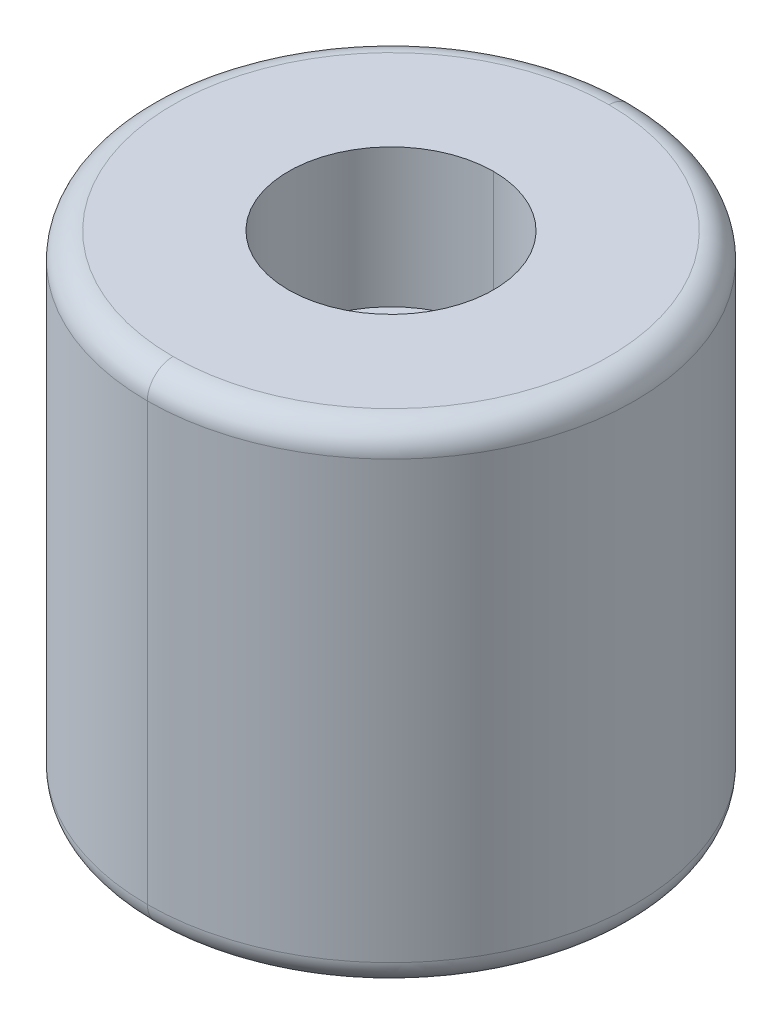
ISO-10303-21;
HEADER;
FILE_DESCRIPTION(('STEP AP214'),'2;1');
FILE_NAME('part.step','',(''),(''),'','','');
FILE_SCHEMA(('AUTOMOTIVE_DESIGN { 1 0 10303 214 1 1 1 1 }'));
ENDSEC;
DATA;
#1=APPLICATION_CONTEXT('core data for automotive mechanical design processes');
#2=APPLICATION_PROTOCOL_DEFINITION('international standard','automotive_design',2000,#1);
#3=PRODUCT_CONTEXT('',#1,'mechanical');
#4=PRODUCT('Part','Part','',(#3));
#5=PRODUCT_RELATED_PRODUCT_CATEGORY('part','',(#4));
#6=PRODUCT_DEFINITION_FORMATION('','',#4);
#7=PRODUCT_DEFINITION_CONTEXT('part definition',#1,'design');
#8=PRODUCT_DEFINITION('design','',#6,#7);
#9=PRODUCT_DEFINITION_SHAPE('','',#8);
#10=(LENGTH_UNIT() NAMED_UNIT(*) SI_UNIT(.MILLI.,.METRE.));
#11=(NAMED_UNIT(*) PLANE_ANGLE_UNIT() SI_UNIT($,.RADIAN.));
#12=(NAMED_UNIT(*) SI_UNIT($,.STERADIAN.) SOLID_ANGLE_UNIT());
#13=UNCERTAINTY_MEASURE_WITH_UNIT(LENGTH_MEASURE(1.E-05),#10,'distance_accuracy_value','');
#14=(GEOMETRIC_REPRESENTATION_CONTEXT(3) GLOBAL_UNCERTAINTY_ASSIGNED_CONTEXT((#13)) GLOBAL_UNIT_ASSIGNED_CONTEXT((#10,
#11,#12)) REPRESENTATION_CONTEXT('',''));
#15=CARTESIAN_POINT('',(0.,0.,0.));
#16=DIRECTION('',(0.,0.,1.));
#17=DIRECTION('',(1.,0.,0.));
#18=AXIS2_PLACEMENT_3D('',#15,#16,#17);
#19=CARTESIAN_POINT('',(0.,18.,0.));
#20=DIRECTION('',(0.,1.,0.));
#21=DIRECTION('',(0.,0.,1.));
#22=AXIS2_PLACEMENT_3D('',#19,#20,#21);
#23=TOROIDAL_SURFACE('',#22,8.5,1.);
#24=CARTESIAN_POINT('',(0.,18.,-8.5));
#25=DIRECTION('',(1.,0.,0.));
#26=DIRECTION('',(0.,0.,-1.));
#27=AXIS2_PLACEMENT_3D('',#24,#25,#26);
#28=CIRCLE('',#27,1.);
#29=CARTESIAN_POINT('',(0.,18.,-9.5));
#30=VERTEX_POINT('',#29);
#31=CARTESIAN_POINT('',(0.,19.,-8.5));
#32=VERTEX_POINT('',#31);
#33=EDGE_CURVE('E144',#30,#32,#28,.T.);
#34=ORIENTED_EDGE('',*,*,#33,.F.);
#35=CARTESIAN_POINT('',(0.,18.,0.));
#36=DIRECTION('',(0.,-1.,0.));
#37=DIRECTION('',(0.,0.,1.));
#38=AXIS2_PLACEMENT_3D('',#35,#36,#37);
#39=CIRCLE('',#38,9.5);
#40=CARTESIAN_POINT('',(0.,18.,9.5));
#41=VERTEX_POINT('',#40);
#42=EDGE_CURVE('E119',#41,#30,#39,.T.);
#43=ORIENTED_EDGE('',*,*,#42,.F.);
#44=CARTESIAN_POINT('',(0.,18.,8.5));
#45=DIRECTION('',(-1.,0.,0.));
#46=DIRECTION('',(0.,0.,1.));
#47=AXIS2_PLACEMENT_3D('',#44,#45,#46);
#48=CIRCLE('',#47,1.);
#49=CARTESIAN_POINT('',(0.,19.,8.5));
#50=VERTEX_POINT('',#49);
#51=EDGE_CURVE('E153',#41,#50,#48,.T.);
#52=ORIENTED_EDGE('',*,*,#51,.T.);
#53=CARTESIAN_POINT('',(0.,19.,0.));
#54=DIRECTION('',(0.,1.,0.));
#55=DIRECTION('',(0.,0.,1.));
#56=AXIS2_PLACEMENT_3D('',#53,#54,#55);
#57=CIRCLE('',#56,8.5);
#58=EDGE_CURVE('E145',#32,#50,#57,.T.);
#59=ORIENTED_EDGE('',*,*,#58,.F.);
#60=EDGE_LOOP('',(#34,#43,#52,#59));
#61=FACE_BOUND('',#60,.T.);
#62=ADVANCED_FACE('F16',(#61),#23,.T.);
#63=CARTESIAN_POINT('',(0.,1.,0.));
#64=DIRECTION('',(0.,1.,0.));
#65=DIRECTION('',(0.,0.,1.));
#66=AXIS2_PLACEMENT_3D('',#63,#64,#65);
#67=TOROIDAL_SURFACE('',#66,8.5,1.);
#68=CARTESIAN_POINT('',(0.,1.,-8.5));
#69=DIRECTION('',(1.,0.,0.));
#70=DIRECTION('',(0.,0.,-1.));
#71=AXIS2_PLACEMENT_3D('',#68,#69,#70);
#72=CIRCLE('',#71,1.);
#73=CARTESIAN_POINT('',(0.,0.,-8.5));
#74=VERTEX_POINT('',#73);
#75=CARTESIAN_POINT('',(0.,1.,-9.5));
#76=VERTEX_POINT('',#75);
#77=EDGE_CURVE('E172',#74,#76,#72,.T.);
#78=ORIENTED_EDGE('',*,*,#77,.F.);
#79=CARTESIAN_POINT('',(0.,0.,0.));
#80=DIRECTION('',(0.,-1.,0.));
#81=DIRECTION('',(0.,0.,1.));
#82=AXIS2_PLACEMENT_3D('',#79,#80,#81);
#83=CIRCLE('',#82,8.5);
#84=CARTESIAN_POINT('',(0.,0.,8.5));
#85=VERTEX_POINT('',#84);
#86=EDGE_CURVE('E166',#85,#74,#83,.T.);
#87=ORIENTED_EDGE('',*,*,#86,.F.);
#88=CARTESIAN_POINT('',(0.,1.,8.5));
#89=DIRECTION('',(-1.,0.,0.));
#90=DIRECTION('',(0.,0.,1.));
#91=AXIS2_PLACEMENT_3D('',#88,#89,#90);
#92=CIRCLE('',#91,1.);
#93=CARTESIAN_POINT('',(0.,1.,9.5));
#94=VERTEX_POINT('',#93);
#95=EDGE_CURVE('E167',#85,#94,#92,.T.);
#96=ORIENTED_EDGE('',*,*,#95,.T.);
#97=CARTESIAN_POINT('',(0.,1.,0.));
#98=DIRECTION('',(0.,1.,0.));
#99=DIRECTION('',(0.,0.,1.));
#100=AXIS2_PLACEMENT_3D('',#97,#98,#99);
#101=CIRCLE('',#100,9.5);
#102=EDGE_CURVE('E131',#76,#94,#101,.T.);
#103=ORIENTED_EDGE('',*,*,#102,.F.);
#104=EDGE_LOOP('',(#78,#87,#96,#103));
#105=FACE_BOUND('',#104,.T.);
#106=ADVANCED_FACE('F261',(#105),#67,.T.);
#107=CARTESIAN_POINT('',(0.,-7.4,0.));
#108=DIRECTION('',(0.,1.,0.));
#109=DIRECTION('',(0.,0.,1.));
#110=AXIS2_PLACEMENT_3D('',#107,#108,#109);
#111=CYLINDRICAL_SURFACE('',#110,1.5);
#112=DIRECTION('',(0.,1.,0.));
#113=VECTOR('',#112,1.);
#114=CARTESIAN_POINT('',(0.,-7.4,-1.5));
#115=LINE('',#114,#113);
#116=CARTESIAN_POINT('',(0.,5.4,-1.5));
#117=VERTEX_POINT('',#116);
#118=CARTESIAN_POINT('',(0.,13.6,-1.5));
#119=VERTEX_POINT('',#118);
#120=EDGE_CURVE('E192',#117,#119,#115,.T.);
#121=ORIENTED_EDGE('',*,*,#120,.F.);
#122=CARTESIAN_POINT('',(0.,5.4,0.));
#123=DIRECTION('',(0.,1.,0.));
#124=DIRECTION('',(0.,0.,1.));
#125=AXIS2_PLACEMENT_3D('',#122,#123,#124);
#126=CIRCLE('',#125,1.5);
#127=CARTESIAN_POINT('',(0.,5.4,1.5));
#128=VERTEX_POINT('',#127);
#129=EDGE_CURVE('E10',#128,#117,#126,.T.);
#130=ORIENTED_EDGE('',*,*,#129,.F.);
#131=DIRECTION('',(0.,1.,0.));
#132=VECTOR('',#131,1.);
#133=CARTESIAN_POINT('',(0.,-7.4,1.5));
#134=LINE('',#133,#132);
#135=CARTESIAN_POINT('',(0.,13.6,1.5));
#136=VERTEX_POINT('',#135);
#137=EDGE_CURVE('E201',#128,#136,#134,.T.);
#138=ORIENTED_EDGE('',*,*,#137,.T.);
#139=CARTESIAN_POINT('',(0.,13.6,0.));
#140=DIRECTION('',(0.,1.,0.));
#141=DIRECTION('',(0.,0.,1.));
#142=AXIS2_PLACEMENT_3D('',#139,#140,#141);
#143=CIRCLE('',#142,1.5);
#144=EDGE_CURVE('E235',#136,#119,#143,.T.);
#145=ORIENTED_EDGE('',*,*,#144,.T.);
#146=EDGE_LOOP('',(#121,#130,#138,#145));
#147=FACE_BOUND('',#146,.T.);
#148=ADVANCED_FACE('F251',(#147),#111,.F.);
#149=CARTESIAN_POINT('',(0.,5.4,0.));
#150=DIRECTION('',(0.,1.,0.));
#151=DIRECTION('',(1.,0.,0.));
#152=AXIS2_PLACEMENT_3D('',#149,#150,#151);
#153=PLANE('',#152);
#154=ORIENTED_EDGE('',*,*,#129,.T.);
#155=CARTESIAN_POINT('',(0.,5.4,0.));
#156=DIRECTION('',(0.,1.,0.));
#157=DIRECTION('',(0.,0.,1.));
#158=AXIS2_PLACEMENT_3D('',#155,#156,#157);
#159=CIRCLE('',#158,1.5);
#160=EDGE_CURVE('E171',#117,#128,#159,.T.);
#161=ORIENTED_EDGE('',*,*,#160,.T.);
#162=EDGE_LOOP('',(#154,#161));
#163=FACE_BOUND('',#162,.T.);
#164=CARTESIAN_POINT('',(0.,5.4,0.));
#165=DIRECTION('',(0.,1.,0.));
#166=DIRECTION('',(0.,0.,1.));
#167=AXIS2_PLACEMENT_3D('',#164,#165,#166);
#168=CIRCLE('',#167,4.);
#169=CARTESIAN_POINT('',(0.,5.4,-4.));
#170=VERTEX_POINT('',#169);
#171=CARTESIAN_POINT('',(0.,5.4,4.));
#172=VERTEX_POINT('',#171);
#173=EDGE_CURVE('E202',#170,#172,#168,.T.);
#174=ORIENTED_EDGE('',*,*,#173,.F.);
#175=CARTESIAN_POINT('',(0.,5.4,0.));
#176=DIRECTION('',(0.,1.,0.));
#177=DIRECTION('',(0.,0.,1.));
#178=AXIS2_PLACEMENT_3D('',#175,#176,#177);
#179=CIRCLE('',#178,4.);
#180=EDGE_CURVE('E24',#172,#170,#179,.T.);
#181=ORIENTED_EDGE('',*,*,#180,.F.);
#182=EDGE_LOOP('',(#174,#181));
#183=FACE_BOUND('',#182,.T.);
#184=ADVANCED_FACE('F249',(#163,#183),#153,.F.);
#185=CARTESIAN_POINT('',(0.,5.4,0.));
#186=DIRECTION('',(0.,-1.,0.));
#187=DIRECTION('',(0.,0.,-1.));
#188=AXIS2_PLACEMENT_3D('',#185,#186,#187);
#189=CYLINDRICAL_SURFACE('',#188,4.);
#190=DIRECTION('',(0.,-1.,0.));
#191=VECTOR('',#190,1.);
#192=CARTESIAN_POINT('',(0.,5.4,4.));
#193=LINE('',#192,#191);
#194=CARTESIAN_POINT('',(0.,0.,4.));
#195=VERTEX_POINT('',#194);
#196=EDGE_CURVE('E206',#172,#195,#193,.T.);
#197=ORIENTED_EDGE('',*,*,#196,.F.);
#198=ORIENTED_EDGE('',*,*,#180,.T.);
#199=DIRECTION('',(0.,-1.,0.));
#200=VECTOR('',#199,1.);
#201=CARTESIAN_POINT('',(0.,5.4,-4.));
#202=LINE('',#201,#200);
#203=CARTESIAN_POINT('',(0.,0.,-4.));
#204=VERTEX_POINT('',#203);
#205=EDGE_CURVE('E188',#170,#204,#202,.T.);
#206=ORIENTED_EDGE('',*,*,#205,.T.);
#207=CARTESIAN_POINT('',(0.,0.,0.));
#208=DIRECTION('',(0.,1.,0.));
#209=DIRECTION('',(0.,0.,1.));
#210=AXIS2_PLACEMENT_3D('',#207,#208,#209);
#211=CIRCLE('',#210,4.);
#212=EDGE_CURVE('E163',#195,#204,#211,.T.);
#213=ORIENTED_EDGE('',*,*,#212,.F.);
#214=EDGE_LOOP('',(#197,#198,#206,#213));
#215=FACE_BOUND('',#214,.T.);
#216=ADVANCED_FACE('F243',(#215),#189,.F.);
#217=CARTESIAN_POINT('',(0.,13.6,0.));
#218=DIRECTION('',(0.,1.,0.));
#219=DIRECTION('',(1.,0.,0.));
#220=AXIS2_PLACEMENT_3D('',#217,#218,#219);
#221=PLANE('',#220);
#222=ORIENTED_EDGE('',*,*,#144,.F.);
#223=CARTESIAN_POINT('',(0.,13.6,0.));
#224=DIRECTION('',(0.,1.,0.));
#225=DIRECTION('',(0.,0.,1.));
#226=AXIS2_PLACEMENT_3D('',#223,#224,#225);
#227=CIRCLE('',#226,1.5);
#228=EDGE_CURVE('E197',#119,#136,#227,.T.);
#229=ORIENTED_EDGE('',*,*,#228,.F.);
#230=EDGE_LOOP('',(#222,#229));
#231=FACE_BOUND('',#230,.T.);
#232=CARTESIAN_POINT('',(0.,13.6,0.));
#233=DIRECTION('',(0.,1.,0.));
#234=DIRECTION('',(0.,0.,1.));
#235=AXIS2_PLACEMENT_3D('',#232,#233,#234);
#236=CIRCLE('',#235,4.);
#237=CARTESIAN_POINT('',(0.,13.6,4.));
#238=VERTEX_POINT('',#237);
#239=CARTESIAN_POINT('',(0.,13.6,-4.));
#240=VERTEX_POINT('',#239);
#241=EDGE_CURVE('E165',#238,#240,#236,.T.);
#242=ORIENTED_EDGE('',*,*,#241,.T.);
#243=CARTESIAN_POINT('',(0.,13.6,0.));
#244=DIRECTION('',(0.,1.,0.));
#245=DIRECTION('',(0.,0.,1.));
#246=AXIS2_PLACEMENT_3D('',#243,#244,#245);
#247=CIRCLE('',#246,4.);
#248=EDGE_CURVE('E183',#240,#238,#247,.T.);
#249=ORIENTED_EDGE('',*,*,#248,.T.);
#250=EDGE_LOOP('',(#242,#249));
#251=FACE_BOUND('',#250,.T.);
#252=ADVANCED_FACE('F259',(#231,#251),#221,.T.);
#253=CARTESIAN_POINT('',(0.,13.6,0.));
#254=DIRECTION('',(0.,1.,0.));
#255=DIRECTION('',(0.,0.,1.));
#256=AXIS2_PLACEMENT_3D('',#253,#254,#255);
#257=CYLINDRICAL_SURFACE('',#256,4.);
#258=DIRECTION('',(0.,1.,0.));
#259=VECTOR('',#258,1.);
#260=CARTESIAN_POINT('',(0.,13.6,-4.));
#261=LINE('',#260,#259);
#262=CARTESIAN_POINT('',(0.,19.,-4.));
#263=VERTEX_POINT('',#262);
#264=EDGE_CURVE('E187',#240,#263,#261,.T.);
#265=ORIENTED_EDGE('',*,*,#264,.F.);
#266=ORIENTED_EDGE('',*,*,#241,.F.);
#267=DIRECTION('',(0.,1.,0.));
#268=VECTOR('',#267,1.);
#269=CARTESIAN_POINT('',(0.,13.6,4.));
#270=LINE('',#269,#268);
#271=CARTESIAN_POINT('',(0.,19.,4.));
#272=VERTEX_POINT('',#271);
#273=EDGE_CURVE('E222',#238,#272,#270,.T.);
#274=ORIENTED_EDGE('',*,*,#273,.T.);
#275=CARTESIAN_POINT('',(0.,19.,0.));
#276=DIRECTION('',(0.,1.,0.));
#277=DIRECTION('',(0.,0.,1.));
#278=AXIS2_PLACEMENT_3D('',#275,#276,#277);
#279=CIRCLE('',#278,4.);
#280=EDGE_CURVE('E36',#272,#263,#279,.T.);
#281=ORIENTED_EDGE('',*,*,#280,.T.);
#282=EDGE_LOOP('',(#265,#266,#274,#281));
#283=FACE_BOUND('',#282,.T.);
#284=ADVANCED_FACE('F288',(#283),#257,.F.);
#285=CARTESIAN_POINT('',(0.,0.,0.));
#286=DIRECTION('',(0.,1.,0.));
#287=DIRECTION('',(1.,0.,0.));
#288=AXIS2_PLACEMENT_3D('',#285,#286,#287);
#289=PLANE('',#288);
#290=CARTESIAN_POINT('',(0.,0.,0.));
#291=DIRECTION('',(0.,1.,0.));
#292=DIRECTION('',(0.,0.,1.));
#293=AXIS2_PLACEMENT_3D('',#290,#291,#292);
#294=CIRCLE('',#293,4.);
#295=EDGE_CURVE('E196',#204,#195,#294,.T.);
#296=ORIENTED_EDGE('',*,*,#295,.T.);
#297=ORIENTED_EDGE('',*,*,#212,.T.);
#298=EDGE_LOOP('',(#296,#297));
#299=FACE_BOUND('',#298,.T.);
#300=ORIENTED_EDGE('',*,*,#86,.T.);
#301=CARTESIAN_POINT('',(0.,0.,0.));
#302=DIRECTION('',(0.,-1.,0.));
#303=DIRECTION('',(0.,0.,1.));
#304=AXIS2_PLACEMENT_3D('',#301,#302,#303);
#305=CIRCLE('',#304,8.5);
#306=EDGE_CURVE('E174',#74,#85,#305,.T.);
#307=ORIENTED_EDGE('',*,*,#306,.T.);
#308=EDGE_LOOP('',(#300,#307));
#309=FACE_BOUND('',#308,.T.);
#310=ADVANCED_FACE('F291',(#299,#309),#289,.F.);
#311=CARTESIAN_POINT('',(0.,19.,0.));
#312=DIRECTION('',(0.,1.,0.));
#313=DIRECTION('',(1.,0.,0.));
#314=AXIS2_PLACEMENT_3D('',#311,#312,#313);
#315=PLANE('',#314);
#316=ORIENTED_EDGE('',*,*,#280,.F.);
#317=CARTESIAN_POINT('',(0.,19.,0.));
#318=DIRECTION('',(0.,1.,0.));
#319=DIRECTION('',(0.,0.,1.));
#320=AXIS2_PLACEMENT_3D('',#317,#318,#319);
#321=CIRCLE('',#320,4.);
#322=EDGE_CURVE('E216',#263,#272,#321,.T.);
#323=ORIENTED_EDGE('',*,*,#322,.F.);
#324=EDGE_LOOP('',(#316,#323));
#325=FACE_BOUND('',#324,.T.);
#326=CARTESIAN_POINT('',(0.,19.,0.));
#327=DIRECTION('',(0.,1.,0.));
#328=DIRECTION('',(0.,0.,1.));
#329=AXIS2_PLACEMENT_3D('',#326,#327,#328);
#330=CIRCLE('',#329,8.5);
#331=EDGE_CURVE('E150',#50,#32,#330,.T.);
#332=ORIENTED_EDGE('',*,*,#331,.T.);
#333=ORIENTED_EDGE('',*,*,#58,.T.);
#334=EDGE_LOOP('',(#332,#333));
#335=FACE_BOUND('',#334,.T.);
#336=ADVANCED_FACE('F287',(#325,#335),#315,.T.);
#337=CARTESIAN_POINT('',(0.,19.,0.));
#338=DIRECTION('',(0.,-1.,0.));
#339=DIRECTION('',(0.,0.,-1.));
#340=AXIS2_PLACEMENT_3D('',#337,#338,#339);
#341=CYLINDRICAL_SURFACE('',#340,9.5);
#342=DIRECTION('',(0.,-1.,0.));
#343=VECTOR('',#342,1.);
#344=CARTESIAN_POINT('',(0.,19.,9.5));
#345=LINE('',#344,#343);
#346=EDGE_CURVE('E125',#41,#94,#345,.T.);
#347=ORIENTED_EDGE('',*,*,#346,.F.);
#348=ORIENTED_EDGE('',*,*,#42,.T.);
#349=DIRECTION('',(0.,-1.,0.));
#350=VECTOR('',#349,1.);
#351=CARTESIAN_POINT('',(0.,19.,-9.5));
#352=LINE('',#351,#350);
#353=EDGE_CURVE('E122',#30,#76,#352,.T.);
#354=ORIENTED_EDGE('',*,*,#353,.T.);
#355=ORIENTED_EDGE('',*,*,#102,.T.);
#356=EDGE_LOOP('',(#347,#348,#354,#355));
#357=FACE_BOUND('',#356,.T.);
#358=ADVANCED_FACE('F121',(#357),#341,.T.);
#359=CARTESIAN_POINT('',(0.,19.,0.));
#360=DIRECTION('',(0.,-1.,0.));
#361=DIRECTION('',(0.,0.,-1.));
#362=AXIS2_PLACEMENT_3D('',#359,#360,#361);
#363=CYLINDRICAL_SURFACE('',#362,9.5);
#364=CARTESIAN_POINT('',(0.,18.,0.));
#365=DIRECTION('',(0.,-1.,0.));
#366=DIRECTION('',(0.,0.,1.));
#367=AXIS2_PLACEMENT_3D('',#364,#365,#366);
#368=CIRCLE('',#367,9.5);
#369=EDGE_CURVE('E137',#30,#41,#368,.T.);
#370=ORIENTED_EDGE('',*,*,#369,.T.);
#371=ORIENTED_EDGE('',*,*,#346,.T.);
#372=CARTESIAN_POINT('',(0.,1.,0.));
#373=DIRECTION('',(0.,1.,0.));
#374=DIRECTION('',(0.,0.,1.));
#375=AXIS2_PLACEMENT_3D('',#372,#373,#374);
#376=CIRCLE('',#375,9.5);
#377=EDGE_CURVE('E139',#94,#76,#376,.T.);
#378=ORIENTED_EDGE('',*,*,#377,.T.);
#379=ORIENTED_EDGE('',*,*,#353,.F.);
#380=EDGE_LOOP('',(#370,#371,#378,#379));
#381=FACE_BOUND('',#380,.T.);
#382=ADVANCED_FACE('F135',(#381),#363,.T.);
#383=CARTESIAN_POINT('',(0.,13.6,0.));
#384=DIRECTION('',(0.,1.,0.));
#385=DIRECTION('',(0.,0.,1.));
#386=AXIS2_PLACEMENT_3D('',#383,#384,#385);
#387=CYLINDRICAL_SURFACE('',#386,4.);
#388=ORIENTED_EDGE('',*,*,#248,.F.);
#389=ORIENTED_EDGE('',*,*,#264,.T.);
#390=ORIENTED_EDGE('',*,*,#322,.T.);
#391=ORIENTED_EDGE('',*,*,#273,.F.);
#392=EDGE_LOOP('',(#388,#389,#390,#391));
#393=FACE_BOUND('',#392,.T.);
#394=ADVANCED_FACE('F279',(#393),#387,.F.);
#395=CARTESIAN_POINT('',(0.,5.4,0.));
#396=DIRECTION('',(0.,-1.,0.));
#397=DIRECTION('',(0.,0.,-1.));
#398=AXIS2_PLACEMENT_3D('',#395,#396,#397);
#399=CYLINDRICAL_SURFACE('',#398,4.);
#400=ORIENTED_EDGE('',*,*,#173,.T.);
#401=ORIENTED_EDGE('',*,*,#196,.T.);
#402=ORIENTED_EDGE('',*,*,#295,.F.);
#403=ORIENTED_EDGE('',*,*,#205,.F.);
#404=EDGE_LOOP('',(#400,#401,#402,#403));
#405=FACE_BOUND('',#404,.T.);
#406=ADVANCED_FACE('F248',(#405),#399,.F.);
#407=CARTESIAN_POINT('',(0.,-7.4,0.));
#408=DIRECTION('',(0.,1.,0.));
#409=DIRECTION('',(0.,0.,1.));
#410=AXIS2_PLACEMENT_3D('',#407,#408,#409);
#411=CYLINDRICAL_SURFACE('',#410,1.5);
#412=ORIENTED_EDGE('',*,*,#160,.F.);
#413=ORIENTED_EDGE('',*,*,#120,.T.);
#414=ORIENTED_EDGE('',*,*,#228,.T.);
#415=ORIENTED_EDGE('',*,*,#137,.F.);
#416=EDGE_LOOP('',(#412,#413,#414,#415));
#417=FACE_BOUND('',#416,.T.);
#418=ADVANCED_FACE('F275',(#417),#411,.F.);
#419=CARTESIAN_POINT('',(0.,1.,0.));
#420=DIRECTION('',(0.,1.,0.));
#421=DIRECTION('',(0.,0.,1.));
#422=AXIS2_PLACEMENT_3D('',#419,#420,#421);
#423=TOROIDAL_SURFACE('',#422,8.5,1.);
#424=ORIENTED_EDGE('',*,*,#306,.F.);
#425=ORIENTED_EDGE('',*,*,#77,.T.);
#426=ORIENTED_EDGE('',*,*,#377,.F.);
#427=ORIENTED_EDGE('',*,*,#95,.F.);
#428=EDGE_LOOP('',(#424,#425,#426,#427));
#429=FACE_BOUND('',#428,.T.);
#430=ADVANCED_FACE('F413',(#429),#423,.T.);
#431=CARTESIAN_POINT('',(0.,18.,0.));
#432=DIRECTION('',(0.,1.,0.));
#433=DIRECTION('',(0.,0.,1.));
#434=AXIS2_PLACEMENT_3D('',#431,#432,#433);
#435=TOROIDAL_SURFACE('',#434,8.5,1.);
#436=ORIENTED_EDGE('',*,*,#369,.F.);
#437=ORIENTED_EDGE('',*,*,#33,.T.);
#438=ORIENTED_EDGE('',*,*,#331,.F.);
#439=ORIENTED_EDGE('',*,*,#51,.F.);
#440=EDGE_LOOP('',(#436,#437,#438,#439));
#441=FACE_BOUND('',#440,.T.);
#442=ADVANCED_FACE('F152',(#441),#435,.T.);
#443=CLOSED_SHELL('',(#62,#106,#148,#184,#216,#252,#284,#310,#336,#358,#382,#394,#406,#418,#430,#442));
#444=MANIFOLD_SOLID_BREP('B1',#443);
#445=ADVANCED_BREP_SHAPE_REPRESENTATION('',(#18,#444),#14);
#446=SHAPE_DEFINITION_REPRESENTATION(#9,#445);
ENDSEC;
END-ISO-10303-21;
